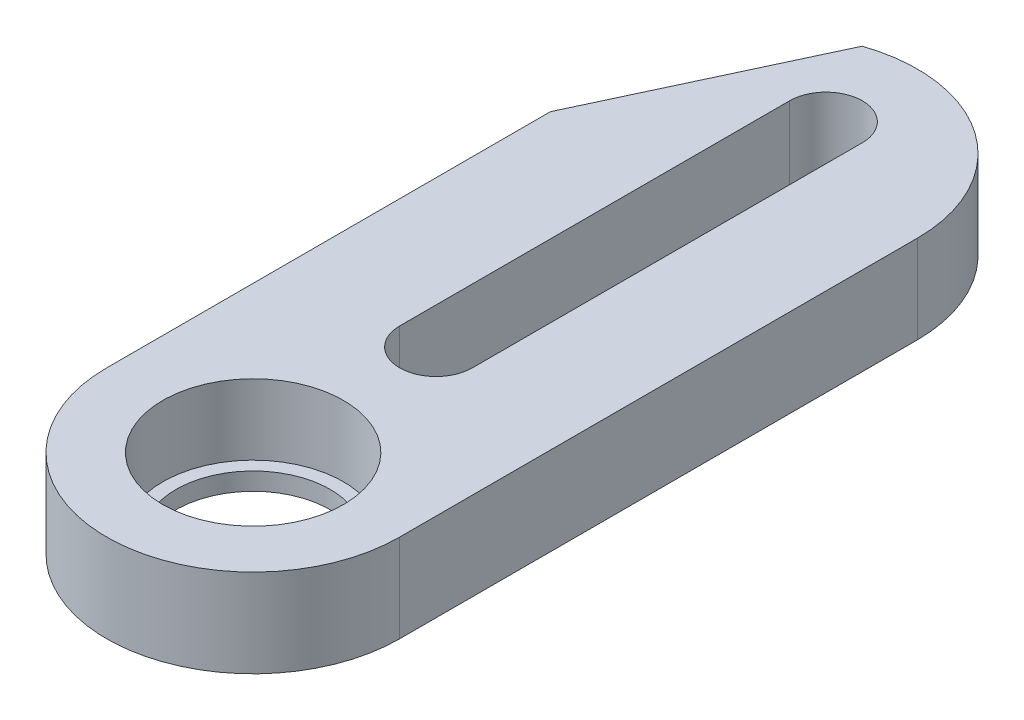
ISO-10303-21;
HEADER;
FILE_DESCRIPTION(('STEP AP214'),'2;1');
FILE_NAME('part.step','',(''),(''),'','','');
FILE_SCHEMA(('AUTOMOTIVE_DESIGN { 1 0 10303 214 1 1 1 1 }'));
ENDSEC;
DATA;
#1=APPLICATION_CONTEXT('core data for automotive mechanical design processes');
#2=APPLICATION_PROTOCOL_DEFINITION('international standard','automotive_design',2000,#1);
#3=PRODUCT_CONTEXT('',#1,'mechanical');
#4=PRODUCT('Part','Part','',(#3));
#5=PRODUCT_RELATED_PRODUCT_CATEGORY('part','',(#4));
#6=PRODUCT_DEFINITION_FORMATION('','',#4);
#7=PRODUCT_DEFINITION_CONTEXT('part definition',#1,'design');
#8=PRODUCT_DEFINITION('design','',#6,#7);
#9=PRODUCT_DEFINITION_SHAPE('','',#8);
#10=(LENGTH_UNIT() NAMED_UNIT(*) SI_UNIT(.MILLI.,.METRE.));
#11=(NAMED_UNIT(*) PLANE_ANGLE_UNIT() SI_UNIT($,.RADIAN.));
#12=(NAMED_UNIT(*) SI_UNIT($,.STERADIAN.) SOLID_ANGLE_UNIT());
#13=UNCERTAINTY_MEASURE_WITH_UNIT(LENGTH_MEASURE(1.E-05),#10,'distance_accuracy_value','');
#14=(GEOMETRIC_REPRESENTATION_CONTEXT(3) GLOBAL_UNCERTAINTY_ASSIGNED_CONTEXT((#13)) GLOBAL_UNIT_ASSIGNED_CONTEXT((#10,
#11,#12)) REPRESENTATION_CONTEXT('',''));
#15=CARTESIAN_POINT('',(0.,0.,0.));
#16=DIRECTION('',(0.,0.,1.));
#17=DIRECTION('',(1.,0.,0.));
#18=AXIS2_PLACEMENT_3D('',#15,#16,#17);
#19=CARTESIAN_POINT('',(0.,4.,0.));
#20=DIRECTION('',(0.,-1.,0.));
#21=DIRECTION('',(0.,0.,-1.));
#22=AXIS2_PLACEMENT_3D('',#19,#20,#21);
#23=CYLINDRICAL_SURFACE('',#22,6.65);
#24=CARTESIAN_POINT('',(0.,0.,0.));
#25=DIRECTION('',(0.,1.,0.));
#26=DIRECTION('',(0.,0.,1.));
#27=AXIS2_PLACEMENT_3D('',#24,#25,#26);
#28=CIRCLE('',#27,6.65);
#29=CARTESIAN_POINT('',(-6.65,0.,0.));
#30=VERTEX_POINT('',#29);
#31=CARTESIAN_POINT('',(6.65,0.,0.));
#32=VERTEX_POINT('',#31);
#33=EDGE_CURVE('E125',#30,#32,#28,.T.);
#34=ORIENTED_EDGE('',*,*,#33,.T.);
#35=DIRECTION('',(0.,-1.,0.));
#36=VECTOR('',#35,1.);
#37=CARTESIAN_POINT('',(6.65,4.,0.));
#38=LINE('',#37,#36);
#39=CARTESIAN_POINT('',(6.65,4.,0.));
#40=VERTEX_POINT('',#39);
#41=EDGE_CURVE('E45',#40,#32,#38,.T.);
#42=ORIENTED_EDGE('',*,*,#41,.F.);
#43=CARTESIAN_POINT('',(0.,4.,0.));
#44=DIRECTION('',(0.,1.,0.));
#45=DIRECTION('',(0.,0.,1.));
#46=AXIS2_PLACEMENT_3D('',#43,#44,#45);
#47=CIRCLE('',#46,6.65);
#48=CARTESIAN_POINT('',(-6.65,4.,0.));
#49=VERTEX_POINT('',#48);
#50=EDGE_CURVE('E114',#49,#40,#47,.T.);
#51=ORIENTED_EDGE('',*,*,#50,.F.);
#52=DIRECTION('',(0.,-1.,0.));
#53=VECTOR('',#52,1.);
#54=CARTESIAN_POINT('',(-6.65,4.,0.));
#55=LINE('',#54,#53);
#56=EDGE_CURVE('E61',#49,#30,#55,.T.);
#57=ORIENTED_EDGE('',*,*,#56,.T.);
#58=EDGE_LOOP('',(#34,#42,#51,#57));
#59=FACE_BOUND('',#58,.T.);
#60=ADVANCED_FACE('F37',(#59),#23,.T.);
#61=CARTESIAN_POINT('',(6.65,4.,0.));
#62=DIRECTION('',(1.,0.,0.));
#63=DIRECTION('',(0.,0.,-1.));
#64=AXIS2_PLACEMENT_3D('',#61,#62,#63);
#65=PLANE('',#64);
#66=DIRECTION('',(0.,0.,1.));
#67=VECTOR('',#66,1.);
#68=CARTESIAN_POINT('',(6.65,0.,0.));
#69=LINE('',#68,#67);
#70=CARTESIAN_POINT('',(6.65,0.,-23.5));
#71=VERTEX_POINT('',#70);
#72=EDGE_CURVE('E158',#71,#32,#69,.T.);
#73=ORIENTED_EDGE('',*,*,#72,.F.);
#74=DIRECTION('',(0.,-1.,0.));
#75=VECTOR('',#74,1.);
#76=CARTESIAN_POINT('',(6.65,4.,-23.5));
#77=LINE('',#76,#75);
#78=CARTESIAN_POINT('',(6.65,4.,-23.5));
#79=VERTEX_POINT('',#78);
#80=EDGE_CURVE('E129',#79,#71,#77,.T.);
#81=ORIENTED_EDGE('',*,*,#80,.F.);
#82=DIRECTION('',(0.,0.,1.));
#83=VECTOR('',#82,1.);
#84=CARTESIAN_POINT('',(6.65,4.,0.));
#85=LINE('',#84,#83);
#86=EDGE_CURVE('E121',#79,#40,#85,.T.);
#87=ORIENTED_EDGE('',*,*,#86,.T.);
#88=ORIENTED_EDGE('',*,*,#41,.T.);
#89=EDGE_LOOP('',(#73,#81,#87,#88));
#90=FACE_BOUND('',#89,.T.);
#91=ADVANCED_FACE('F132',(#90),#65,.T.);
#92=CARTESIAN_POINT('',(0.,4.,-23.5));
#93=DIRECTION('',(0.,-1.,0.));
#94=DIRECTION('',(0.,0.,-1.));
#95=AXIS2_PLACEMENT_3D('',#92,#93,#94);
#96=CYLINDRICAL_SURFACE('',#95,6.65);
#97=DIRECTION('',(0.,-1.,0.));
#98=VECTOR('',#97,1.);
#99=CARTESIAN_POINT('',(-2.15,4.,-29.7928530890209));
#100=LINE('',#99,#98);
#101=CARTESIAN_POINT('',(-2.15,4.,-29.7928530890209));
#102=VERTEX_POINT('',#101);
#103=CARTESIAN_POINT('',(-2.15,0.,-29.7928530890209));
#104=VERTEX_POINT('',#103);
#105=EDGE_CURVE('E52',#102,#104,#100,.T.);
#106=ORIENTED_EDGE('',*,*,#105,.F.);
#107=CARTESIAN_POINT('',(0.,4.,-23.5));
#108=DIRECTION('',(0.,1.,0.));
#109=DIRECTION('',(0.,0.,1.));
#110=AXIS2_PLACEMENT_3D('',#107,#108,#109);
#111=CIRCLE('',#110,6.65);
#112=EDGE_CURVE('E134',#102,#79,#111,.F.);
#113=ORIENTED_EDGE('',*,*,#112,.T.);
#114=ORIENTED_EDGE('',*,*,#80,.T.);
#115=CARTESIAN_POINT('',(0.,0.,-23.5));
#116=DIRECTION('',(0.,1.,0.));
#117=DIRECTION('',(0.,0.,1.));
#118=AXIS2_PLACEMENT_3D('',#115,#116,#117);
#119=CIRCLE('',#118,6.65);
#120=EDGE_CURVE('E160',#104,#71,#119,.F.);
#121=ORIENTED_EDGE('',*,*,#120,.F.);
#122=EDGE_LOOP('',(#106,#113,#114,#121));
#123=FACE_BOUND('',#122,.T.);
#124=ADVANCED_FACE('F214',(#123),#96,.T.);
#125=CARTESIAN_POINT('',(0.,4.,-8.3));
#126=DIRECTION('',(0.,-1.,0.));
#127=DIRECTION('',(0.,0.,-1.));
#128=AXIS2_PLACEMENT_3D('',#125,#126,#127);
#129=CYLINDRICAL_SURFACE('',#128,1.65);
#130=CARTESIAN_POINT('',(0.,0.,-8.3));
#131=DIRECTION('',(0.,1.,0.));
#132=DIRECTION('',(0.,0.,1.));
#133=AXIS2_PLACEMENT_3D('',#130,#131,#132);
#134=CIRCLE('',#133,1.65);
#135=CARTESIAN_POINT('',(-1.65,0.,-8.3));
#136=VERTEX_POINT('',#135);
#137=CARTESIAN_POINT('',(1.65,0.,-8.3));
#138=VERTEX_POINT('',#137);
#139=EDGE_CURVE('E144',#136,#138,#134,.T.);
#140=ORIENTED_EDGE('',*,*,#139,.F.);
#141=DIRECTION('',(0.,-1.,0.));
#142=VECTOR('',#141,1.);
#143=CARTESIAN_POINT('',(-1.65,4.,-8.3));
#144=LINE('',#143,#142);
#145=CARTESIAN_POINT('',(-1.65,4.,-8.3));
#146=VERTEX_POINT('',#145);
#147=EDGE_CURVE('E97',#146,#136,#144,.T.);
#148=ORIENTED_EDGE('',*,*,#147,.F.);
#149=CARTESIAN_POINT('',(0.,4.,-8.3));
#150=DIRECTION('',(0.,1.,0.));
#151=DIRECTION('',(0.,0.,1.));
#152=AXIS2_PLACEMENT_3D('',#149,#150,#151);
#153=CIRCLE('',#152,1.65);
#154=CARTESIAN_POINT('',(1.65,4.,-8.3));
#155=VERTEX_POINT('',#154);
#156=EDGE_CURVE('E165',#146,#155,#153,.T.);
#157=ORIENTED_EDGE('',*,*,#156,.T.);
#158=DIRECTION('',(0.,-1.,0.));
#159=VECTOR('',#158,1.);
#160=CARTESIAN_POINT('',(1.65,4.,-8.3));
#161=LINE('',#160,#159);
#162=EDGE_CURVE('E143',#155,#138,#161,.T.);
#163=ORIENTED_EDGE('',*,*,#162,.T.);
#164=EDGE_LOOP('',(#140,#148,#157,#163));
#165=FACE_BOUND('',#164,.T.);
#166=ADVANCED_FACE('F39',(#165),#129,.F.);
#167=CARTESIAN_POINT('',(-1.65,4.,0.));
#168=DIRECTION('',(1.,0.,0.));
#169=DIRECTION('',(0.,0.,-1.));
#170=AXIS2_PLACEMENT_3D('',#167,#168,#169);
#171=PLANE('',#170);
#172=DIRECTION('',(0.,0.,1.));
#173=VECTOR('',#172,1.);
#174=CARTESIAN_POINT('',(-1.65,0.,0.));
#175=LINE('',#174,#173);
#176=CARTESIAN_POINT('',(-1.65,0.,-26.));
#177=VERTEX_POINT('',#176);
#178=EDGE_CURVE('E147',#177,#136,#175,.T.);
#179=ORIENTED_EDGE('',*,*,#178,.F.);
#180=DIRECTION('',(0.,-1.,0.));
#181=VECTOR('',#180,1.);
#182=CARTESIAN_POINT('',(-1.65,4.,-26.));
#183=LINE('',#182,#181);
#184=CARTESIAN_POINT('',(-1.65,4.,-26.));
#185=VERTEX_POINT('',#184);
#186=EDGE_CURVE('E171',#185,#177,#183,.T.);
#187=ORIENTED_EDGE('',*,*,#186,.F.);
#188=DIRECTION('',(0.,0.,1.));
#189=VECTOR('',#188,1.);
#190=CARTESIAN_POINT('',(-1.65,4.,0.));
#191=LINE('',#190,#189);
#192=EDGE_CURVE('E177',#185,#146,#191,.T.);
#193=ORIENTED_EDGE('',*,*,#192,.T.);
#194=ORIENTED_EDGE('',*,*,#147,.T.);
#195=EDGE_LOOP('',(#179,#187,#193,#194));
#196=FACE_BOUND('',#195,.T.);
#197=ADVANCED_FACE('F175',(#196),#171,.T.);
#198=CARTESIAN_POINT('',(0.,4.,-26.));
#199=DIRECTION('',(0.,-1.,0.));
#200=DIRECTION('',(0.,0.,-1.));
#201=AXIS2_PLACEMENT_3D('',#198,#199,#200);
#202=CYLINDRICAL_SURFACE('',#201,1.65);
#203=CARTESIAN_POINT('',(0.,0.,-26.));
#204=DIRECTION('',(0.,1.,0.));
#205=DIRECTION('',(0.,0.,1.));
#206=AXIS2_PLACEMENT_3D('',#203,#204,#205);
#207=CIRCLE('',#206,1.65);
#208=CARTESIAN_POINT('',(1.65,0.,-26.));
#209=VERTEX_POINT('',#208);
#210=EDGE_CURVE('E151',#209,#177,#207,.T.);
#211=ORIENTED_EDGE('',*,*,#210,.F.);
#212=DIRECTION('',(0.,-1.,0.));
#213=VECTOR('',#212,1.);
#214=CARTESIAN_POINT('',(1.65,4.,-26.));
#215=LINE('',#214,#213);
#216=CARTESIAN_POINT('',(1.65,4.,-26.));
#217=VERTEX_POINT('',#216);
#218=EDGE_CURVE('E169',#217,#209,#215,.T.);
#219=ORIENTED_EDGE('',*,*,#218,.F.);
#220=CARTESIAN_POINT('',(0.,4.,-26.));
#221=DIRECTION('',(0.,1.,0.));
#222=DIRECTION('',(0.,0.,1.));
#223=AXIS2_PLACEMENT_3D('',#220,#221,#222);
#224=CIRCLE('',#223,1.65);
#225=EDGE_CURVE('E189',#217,#185,#224,.T.);
#226=ORIENTED_EDGE('',*,*,#225,.T.);
#227=ORIENTED_EDGE('',*,*,#186,.T.);
#228=EDGE_LOOP('',(#211,#219,#226,#227));
#229=FACE_BOUND('',#228,.T.);
#230=ADVANCED_FACE('F185',(#229),#202,.F.);
#231=CARTESIAN_POINT('',(-6.65,4.,0.));
#232=DIRECTION('',(-1.,0.,0.));
#233=DIRECTION('',(0.,0.,1.));
#234=AXIS2_PLACEMENT_3D('',#231,#232,#233);
#235=PLANE('',#234);
#236=DIRECTION('',(0.,-1.,0.));
#237=VECTOR('',#236,1.);
#238=CARTESIAN_POINT('',(-6.65,4.,-20.1425719467277));
#239=LINE('',#238,#237);
#240=CARTESIAN_POINT('',(-6.65,4.,-20.1425719467277));
#241=VERTEX_POINT('',#240);
#242=CARTESIAN_POINT('',(-6.65,0.,-20.1425719467277));
#243=VERTEX_POINT('',#242);
#244=EDGE_CURVE('E240',#241,#243,#239,.T.);
#245=ORIENTED_EDGE('',*,*,#244,.T.);
#246=DIRECTION('',(0.,0.,-1.));
#247=VECTOR('',#246,1.);
#248=CARTESIAN_POINT('',(-6.65,0.,0.));
#249=LINE('',#248,#247);
#250=EDGE_CURVE('E162',#30,#243,#249,.T.);
#251=ORIENTED_EDGE('',*,*,#250,.F.);
#252=ORIENTED_EDGE('',*,*,#56,.F.);
#253=DIRECTION('',(0.,0.,-1.));
#254=VECTOR('',#253,1.);
#255=CARTESIAN_POINT('',(-6.65,4.,0.));
#256=LINE('',#255,#254);
#257=EDGE_CURVE('E122',#49,#241,#256,.T.);
#258=ORIENTED_EDGE('',*,*,#257,.T.);
#259=EDGE_LOOP('',(#245,#251,#252,#258));
#260=FACE_BOUND('',#259,.T.);
#261=ADVANCED_FACE('F199',(#260),#235,.T.);
#262=CARTESIAN_POINT('',(1.65,4.,0.));
#263=DIRECTION('',(1.,0.,0.));
#264=DIRECTION('',(0.,0.,-1.));
#265=AXIS2_PLACEMENT_3D('',#262,#263,#264);
#266=PLANE('',#265);
#267=DIRECTION('',(0.,0.,1.));
#268=VECTOR('',#267,1.);
#269=CARTESIAN_POINT('',(1.65,0.,0.));
#270=LINE('',#269,#268);
#271=EDGE_CURVE('E154',#209,#138,#270,.T.);
#272=ORIENTED_EDGE('',*,*,#271,.T.);
#273=ORIENTED_EDGE('',*,*,#162,.F.);
#274=DIRECTION('',(0.,0.,1.));
#275=VECTOR('',#274,1.);
#276=CARTESIAN_POINT('',(1.65,4.,0.));
#277=LINE('',#276,#275);
#278=EDGE_CURVE('E123',#217,#155,#277,.T.);
#279=ORIENTED_EDGE('',*,*,#278,.F.);
#280=ORIENTED_EDGE('',*,*,#218,.T.);
#281=EDGE_LOOP('',(#272,#273,#279,#280));
#282=FACE_BOUND('',#281,.T.);
#283=ADVANCED_FACE('F196',(#282),#266,.F.);
#284=CARTESIAN_POINT('',(0.,4.,0.));
#285=DIRECTION('',(0.,-1.,0.));
#286=DIRECTION('',(0.,0.,-1.));
#287=AXIS2_PLACEMENT_3D('',#284,#285,#286);
#288=CYLINDRICAL_SURFACE('',#287,4.1);
#289=CARTESIAN_POINT('',(0.,0.8,0.));
#290=DIRECTION('',(0.,1.,0.));
#291=DIRECTION('',(0.,0.,1.));
#292=AXIS2_PLACEMENT_3D('',#289,#290,#291);
#293=CIRCLE('',#292,4.1);
#294=CARTESIAN_POINT('',(0.,0.8,4.1));
#295=VERTEX_POINT('',#294);
#296=EDGE_CURVE('E11',#295,#295,#293,.T.);
#297=ORIENTED_EDGE('',*,*,#296,.F.);
#298=EDGE_LOOP('',(#297));
#299=FACE_BOUND('',#298,.T.);
#300=CARTESIAN_POINT('',(0.,4.,0.));
#301=DIRECTION('',(0.,1.,0.));
#302=DIRECTION('',(0.,0.,1.));
#303=AXIS2_PLACEMENT_3D('',#300,#301,#302);
#304=CIRCLE('',#303,4.1);
#305=CARTESIAN_POINT('',(0.,4.,4.1));
#306=VERTEX_POINT('',#305);
#307=EDGE_CURVE('E140',#306,#306,#304,.T.);
#308=ORIENTED_EDGE('',*,*,#307,.T.);
#309=EDGE_LOOP('',(#308));
#310=FACE_BOUND('',#309,.T.);
#311=ADVANCED_FACE('F198',(#299,#310),#288,.F.);
#312=CARTESIAN_POINT('',(0.,4.,0.));
#313=DIRECTION('',(0.,1.,0.));
#314=DIRECTION('',(0.,0.,1.));
#315=AXIS2_PLACEMENT_3D('',#312,#313,#314);
#316=PLANE('',#315);
#317=DIRECTION('',(-0.422618261740694,0.,0.906307787036653));
#318=VECTOR('',#317,1.);
#319=CARTESIAN_POINT('',(-6.65,4.,-20.1425719467277));
#320=LINE('',#319,#318);
#321=EDGE_CURVE('E243',#102,#241,#320,.T.);
#322=ORIENTED_EDGE('',*,*,#321,.T.);
#323=ORIENTED_EDGE('',*,*,#257,.F.);
#324=ORIENTED_EDGE('',*,*,#50,.T.);
#325=ORIENTED_EDGE('',*,*,#86,.F.);
#326=ORIENTED_EDGE('',*,*,#112,.F.);
#327=EDGE_LOOP('',(#322,#323,#324,#325,#326));
#328=FACE_BOUND('',#327,.T.);
#329=ORIENTED_EDGE('',*,*,#156,.F.);
#330=ORIENTED_EDGE('',*,*,#192,.F.);
#331=ORIENTED_EDGE('',*,*,#225,.F.);
#332=ORIENTED_EDGE('',*,*,#278,.T.);
#333=EDGE_LOOP('',(#329,#330,#331,#332));
#334=FACE_BOUND('',#333,.T.);
#335=ORIENTED_EDGE('',*,*,#307,.F.);
#336=EDGE_LOOP('',(#335));
#337=FACE_BOUND('',#336,.T.);
#338=ADVANCED_FACE('F117',(#328,#334,#337),#316,.T.);
#339=CARTESIAN_POINT('',(0.,0.,0.));
#340=DIRECTION('',(0.,1.,0.));
#341=DIRECTION('',(0.,0.,1.));
#342=AXIS2_PLACEMENT_3D('',#339,#340,#341);
#343=PLANE('',#342);
#344=CARTESIAN_POINT('',(0.,0.,0.));
#345=DIRECTION('',(0.,1.,0.));
#346=DIRECTION('',(0.,0.,1.));
#347=AXIS2_PLACEMENT_3D('',#344,#345,#346);
#348=CIRCLE('',#347,3.5);
#349=CARTESIAN_POINT('',(0.,0.,3.5));
#350=VERTEX_POINT('',#349);
#351=EDGE_CURVE('E148',#350,#350,#348,.T.);
#352=ORIENTED_EDGE('',*,*,#351,.T.);
#353=EDGE_LOOP('',(#352));
#354=FACE_BOUND('',#353,.T.);
#355=ORIENTED_EDGE('',*,*,#139,.T.);
#356=ORIENTED_EDGE('',*,*,#271,.F.);
#357=ORIENTED_EDGE('',*,*,#210,.T.);
#358=ORIENTED_EDGE('',*,*,#178,.T.);
#359=EDGE_LOOP('',(#355,#356,#357,#358));
#360=FACE_BOUND('',#359,.T.);
#361=ORIENTED_EDGE('',*,*,#250,.T.);
#362=DIRECTION('',(-0.422618261740694,0.,0.906307787036653));
#363=VECTOR('',#362,1.);
#364=CARTESIAN_POINT('',(-6.65,0.,-20.1425719467277));
#365=LINE('',#364,#363);
#366=EDGE_CURVE('E238',#104,#243,#365,.T.);
#367=ORIENTED_EDGE('',*,*,#366,.F.);
#368=ORIENTED_EDGE('',*,*,#120,.T.);
#369=ORIENTED_EDGE('',*,*,#72,.T.);
#370=ORIENTED_EDGE('',*,*,#33,.F.);
#371=EDGE_LOOP('',(#361,#367,#368,#369,#370));
#372=FACE_BOUND('',#371,.T.);
#373=ADVANCED_FACE('F181',(#354,#360,#372),#343,.F.);
#374=CARTESIAN_POINT('',(0.,0.8,0.));
#375=DIRECTION('',(0.,1.,0.));
#376=DIRECTION('',(0.,0.,1.));
#377=AXIS2_PLACEMENT_3D('',#374,#375,#376);
#378=PLANE('',#377);
#379=CARTESIAN_POINT('',(0.,0.8,0.));
#380=DIRECTION('',(0.,1.,0.));
#381=DIRECTION('',(0.,0.,1.));
#382=AXIS2_PLACEMENT_3D('',#379,#380,#381);
#383=CIRCLE('',#382,3.5);
#384=CARTESIAN_POINT('',(0.,0.8,3.5));
#385=VERTEX_POINT('',#384);
#386=EDGE_CURVE('E245',#385,#385,#383,.T.);
#387=ORIENTED_EDGE('',*,*,#386,.F.);
#388=EDGE_LOOP('',(#387));
#389=FACE_BOUND('',#388,.T.);
#390=ORIENTED_EDGE('',*,*,#296,.T.);
#391=EDGE_LOOP('',(#390));
#392=FACE_BOUND('',#391,.T.);
#393=ADVANCED_FACE('F222',(#389,#392),#378,.T.);
#394=CARTESIAN_POINT('',(0.,0.,0.));
#395=DIRECTION('',(0.,1.,0.));
#396=DIRECTION('',(0.,0.,1.));
#397=AXIS2_PLACEMENT_3D('',#394,#395,#396);
#398=CYLINDRICAL_SURFACE('',#397,3.5);
#399=ORIENTED_EDGE('',*,*,#351,.F.);
#400=EDGE_LOOP('',(#399));
#401=FACE_BOUND('',#400,.T.);
#402=ORIENTED_EDGE('',*,*,#386,.T.);
#403=EDGE_LOOP('',(#402));
#404=FACE_BOUND('',#403,.T.);
#405=ADVANCED_FACE('F228',(#401,#404),#398,.F.);
#406=CARTESIAN_POINT('',(-6.65,4.,-20.1425719467277));
#407=DIRECTION('',(0.906307787036653,0.,0.422618261740694));
#408=DIRECTION('',(0.422618261740694,0.,-0.906307787036653));
#409=AXIS2_PLACEMENT_3D('',#406,#407,#408);
#410=PLANE('',#409);
#411=ORIENTED_EDGE('',*,*,#366,.T.);
#412=ORIENTED_EDGE('',*,*,#244,.F.);
#413=ORIENTED_EDGE('',*,*,#321,.F.);
#414=ORIENTED_EDGE('',*,*,#105,.T.);
#415=EDGE_LOOP('',(#411,#412,#413,#414));
#416=FACE_BOUND('',#415,.T.);
#417=ADVANCED_FACE('F232',(#416),#410,.F.);
#418=CLOSED_SHELL('',(#60,#91,#124,#166,#197,#230,#261,#283,#311,#338,#373,#393,#405,#417));
#419=MANIFOLD_SOLID_BREP('B2',#418);
#420=ADVANCED_BREP_SHAPE_REPRESENTATION('',(#18,#419),#14);
#421=SHAPE_DEFINITION_REPRESENTATION(#9,#420);
ENDSEC;
END-ISO-10303-21;
